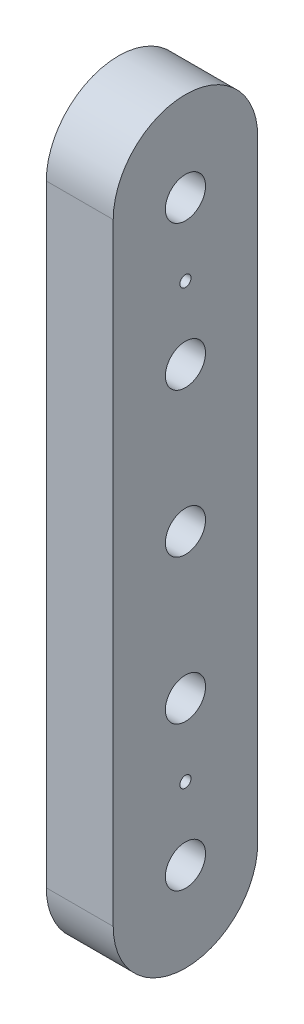
ISO-10303-21;
HEADER;
FILE_DESCRIPTION(('STEP AP214'),'2;1');
FILE_NAME('part.step','',(''),(''),'','','');
FILE_SCHEMA(('AUTOMOTIVE_DESIGN { 1 0 10303 214 1 1 1 1 }'));
ENDSEC;
DATA;
#1=APPLICATION_CONTEXT('core data for automotive mechanical design processes');
#2=APPLICATION_PROTOCOL_DEFINITION('international standard','automotive_design',2000,#1);
#3=PRODUCT_CONTEXT('',#1,'mechanical');
#4=PRODUCT('Part','Part','',(#3));
#5=PRODUCT_RELATED_PRODUCT_CATEGORY('part','',(#4));
#6=PRODUCT_DEFINITION_FORMATION('','',#4);
#7=PRODUCT_DEFINITION_CONTEXT('part definition',#1,'design');
#8=PRODUCT_DEFINITION('design','',#6,#7);
#9=PRODUCT_DEFINITION_SHAPE('','',#8);
#10=(LENGTH_UNIT() NAMED_UNIT(*) SI_UNIT(.MILLI.,.METRE.));
#11=(NAMED_UNIT(*) PLANE_ANGLE_UNIT() SI_UNIT($,.RADIAN.));
#12=(NAMED_UNIT(*) SI_UNIT($,.STERADIAN.) SOLID_ANGLE_UNIT());
#13=UNCERTAINTY_MEASURE_WITH_UNIT(LENGTH_MEASURE(1.E-05),#10,'distance_accuracy_value','');
#14=(GEOMETRIC_REPRESENTATION_CONTEXT(3) GLOBAL_UNCERTAINTY_ASSIGNED_CONTEXT((#13)) GLOBAL_UNIT_ASSIGNED_CONTEXT((#10,
#11,#12)) REPRESENTATION_CONTEXT('',''));
#15=CARTESIAN_POINT('',(0.,0.,0.));
#16=DIRECTION('',(0.,0.,1.));
#17=DIRECTION('',(1.,0.,0.));
#18=AXIS2_PLACEMENT_3D('',#15,#16,#17);
#19=CARTESIAN_POINT('',(990.146797213117,2028.05100619535,-164.79980395356));
#20=DIRECTION('',(1.,0.,0.));
#21=DIRECTION('',(0.,0.,-1.));
#22=AXIS2_PLACEMENT_3D('',#19,#20,#21);
#23=CYLINDRICAL_SURFACE('',#22,82.24980395356);
#24=CARTESIAN_POINT('',(1066.34679721312,2028.05100619535,-164.79980395356));
#25=DIRECTION('',(-1.,0.,0.));
#26=DIRECTION('',(0.,0.,1.));
#27=AXIS2_PLACEMENT_3D('',#24,#25,#26);
#28=CIRCLE('',#27,82.24980395356);
#29=CARTESIAN_POINT('',(1066.34679721312,2028.05100619535,-82.5500000000004));
#30=VERTEX_POINT('',#29);
#31=CARTESIAN_POINT('',(1066.34679721312,2028.05100619535,-247.04960790712));
#32=VERTEX_POINT('',#31);
#33=EDGE_CURVE('E111',#30,#32,#28,.T.);
#34=ORIENTED_EDGE('',*,*,#33,.T.);
#35=DIRECTION('',(1.,0.,0.));
#36=VECTOR('',#35,1.);
#37=CARTESIAN_POINT('',(990.146797213117,2028.05100619535,-247.04960790712));
#38=LINE('',#37,#36);
#39=CARTESIAN_POINT('',(990.146797213117,2028.05100619535,-247.04960790712));
#40=VERTEX_POINT('',#39);
#41=EDGE_CURVE('E13',#40,#32,#38,.T.);
#42=ORIENTED_EDGE('',*,*,#41,.F.);
#43=CARTESIAN_POINT('',(990.146797213117,2028.05100619535,-164.79980395356));
#44=DIRECTION('',(-1.,0.,0.));
#45=DIRECTION('',(0.,0.,1.));
#46=AXIS2_PLACEMENT_3D('',#43,#44,#45);
#47=CIRCLE('',#46,82.24980395356);
#48=CARTESIAN_POINT('',(990.146797213117,2028.05100619535,-82.5500000000004));
#49=VERTEX_POINT('',#48);
#50=EDGE_CURVE('E99',#49,#40,#47,.T.);
#51=ORIENTED_EDGE('',*,*,#50,.F.);
#52=DIRECTION('',(1.,0.,0.));
#53=VECTOR('',#52,1.);
#54=CARTESIAN_POINT('',(990.146797213117,2028.05100619535,-82.5500000000004));
#55=LINE('',#54,#53);
#56=EDGE_CURVE('E107',#49,#30,#55,.T.);
#57=ORIENTED_EDGE('',*,*,#56,.T.);
#58=EDGE_LOOP('',(#34,#42,#51,#57));
#59=FACE_BOUND('',#58,.T.);
#60=ADVANCED_FACE('F48',(#59),#23,.T.);
#61=CARTESIAN_POINT('',(990.146797213117,2028.05100619535,-247.04960790712));
#62=DIRECTION('',(0.,0.,1.));
#63=DIRECTION('',(0.,-1.,0.));
#64=AXIS2_PLACEMENT_3D('',#61,#62,#63);
#65=PLANE('',#64);
#66=DIRECTION('',(0.,-1.,0.));
#67=VECTOR('',#66,1.);
#68=CARTESIAN_POINT('',(1066.34679721312,2028.05100619535,-247.04960790712));
#69=LINE('',#68,#67);
#70=CARTESIAN_POINT('',(1066.34679721312,1331.16375694592,-247.049607907121));
#71=VERTEX_POINT('',#70);
#72=EDGE_CURVE('E103',#32,#71,#69,.T.);
#73=ORIENTED_EDGE('',*,*,#72,.T.);
#74=DIRECTION('',(1.,0.,0.));
#75=VECTOR('',#74,1.);
#76=CARTESIAN_POINT('',(990.146797213117,1331.16375694592,-247.049607907121));
#77=LINE('',#76,#75);
#78=CARTESIAN_POINT('',(990.146797213117,1331.16375694592,-247.049607907121));
#79=VERTEX_POINT('',#78);
#80=EDGE_CURVE('E56',#79,#71,#77,.T.);
#81=ORIENTED_EDGE('',*,*,#80,.F.);
#82=DIRECTION('',(0.,-1.,0.));
#83=VECTOR('',#82,1.);
#84=CARTESIAN_POINT('',(990.146797213117,2028.05100619535,-247.04960790712));
#85=LINE('',#84,#83);
#86=EDGE_CURVE('E94',#40,#79,#85,.T.);
#87=ORIENTED_EDGE('',*,*,#86,.F.);
#88=ORIENTED_EDGE('',*,*,#41,.T.);
#89=EDGE_LOOP('',(#73,#81,#87,#88));
#90=FACE_BOUND('',#89,.T.);
#91=ADVANCED_FACE('F102',(#90),#65,.F.);
#92=CARTESIAN_POINT('',(990.146797213117,1331.16375694592,-164.79980395356));
#93=DIRECTION('',(1.,0.,0.));
#94=DIRECTION('',(0.,0.,-1.));
#95=AXIS2_PLACEMENT_3D('',#92,#93,#94);
#96=CYLINDRICAL_SURFACE('',#95,82.2498039535603);
#97=CARTESIAN_POINT('',(1066.34679721312,1331.16375694592,-164.79980395356));
#98=DIRECTION('',(-1.,0.,0.));
#99=DIRECTION('',(0.,0.,1.));
#100=AXIS2_PLACEMENT_3D('',#97,#98,#99);
#101=CIRCLE('',#100,82.2498039535603);
#102=CARTESIAN_POINT('',(1066.34679721312,1331.16375694592,-82.5499999999999));
#103=VERTEX_POINT('',#102);
#104=EDGE_CURVE('E81',#71,#103,#101,.T.);
#105=ORIENTED_EDGE('',*,*,#104,.T.);
#106=DIRECTION('',(1.,0.,0.));
#107=VECTOR('',#106,1.);
#108=CARTESIAN_POINT('',(990.146797213117,1331.16375694592,-82.5499999999999));
#109=LINE('',#108,#107);
#110=CARTESIAN_POINT('',(990.146797213117,1331.16375694592,-82.5499999999999));
#111=VERTEX_POINT('',#110);
#112=EDGE_CURVE('E104',#111,#103,#109,.T.);
#113=ORIENTED_EDGE('',*,*,#112,.F.);
#114=CARTESIAN_POINT('',(990.146797213117,1331.16375694592,-164.79980395356));
#115=DIRECTION('',(-1.,0.,0.));
#116=DIRECTION('',(0.,0.,1.));
#117=AXIS2_PLACEMENT_3D('',#114,#115,#116);
#118=CIRCLE('',#117,82.2498039535603);
#119=EDGE_CURVE('E97',#79,#111,#118,.T.);
#120=ORIENTED_EDGE('',*,*,#119,.F.);
#121=ORIENTED_EDGE('',*,*,#80,.T.);
#122=EDGE_LOOP('',(#105,#113,#120,#121));
#123=FACE_BOUND('',#122,.T.);
#124=ADVANCED_FACE('F105',(#123),#96,.T.);
#125=CARTESIAN_POINT('',(990.146797213117,1331.16375694592,-82.5499999999999));
#126=DIRECTION('',(0.,0.,-1.));
#127=DIRECTION('',(0.,1.,0.));
#128=AXIS2_PLACEMENT_3D('',#125,#126,#127);
#129=PLANE('',#128);
#130=DIRECTION('',(0.,1.,0.));
#131=VECTOR('',#130,1.);
#132=CARTESIAN_POINT('',(1066.34679721312,1331.16375694592,-82.5499999999999));
#133=LINE('',#132,#131);
#134=EDGE_CURVE('E87',#103,#30,#133,.T.);
#135=ORIENTED_EDGE('',*,*,#134,.T.);
#136=ORIENTED_EDGE('',*,*,#56,.F.);
#137=DIRECTION('',(0.,1.,0.));
#138=VECTOR('',#137,1.);
#139=CARTESIAN_POINT('',(990.146797213117,1331.16375694592,-82.5499999999999));
#140=LINE('',#139,#138);
#141=EDGE_CURVE('E64',#111,#49,#140,.T.);
#142=ORIENTED_EDGE('',*,*,#141,.F.);
#143=ORIENTED_EDGE('',*,*,#112,.T.);
#144=EDGE_LOOP('',(#135,#136,#142,#143));
#145=FACE_BOUND('',#144,.T.);
#146=ADVANCED_FACE('F119',(#145),#129,.F.);
#147=CARTESIAN_POINT('',(990.146797213117,2028.05100619535,-164.79980395356));
#148=DIRECTION('',(-1.,0.,0.));
#149=DIRECTION('',(0.,0.,1.));
#150=AXIS2_PLACEMENT_3D('',#147,#148,#149);
#151=PLANE('',#150);
#152=CARTESIAN_POINT('',(990.146797213117,1432.78731013693,-164.79980395356));
#153=DIRECTION('',(-1.,0.,0.));
#154=DIRECTION('',(0.,0.,1.));
#155=AXIS2_PLACEMENT_3D('',#152,#153,#154);
#156=CIRCLE('',#155,6.35000000000002);
#157=CARTESIAN_POINT('',(990.146797213117,1432.78731013693,-158.44980395356));
#158=VERTEX_POINT('',#157);
#159=EDGE_CURVE('E161',#158,#158,#156,.F.);
#160=ORIENTED_EDGE('',*,*,#159,.T.);
#161=EDGE_LOOP('',(#160));
#162=FACE_BOUND('',#161,.T.);
#163=CARTESIAN_POINT('',(990.146797213117,1926.42745300434,-164.79980395356));
#164=DIRECTION('',(-1.,0.,0.));
#165=DIRECTION('',(0.,0.,1.));
#166=AXIS2_PLACEMENT_3D('',#163,#164,#165);
#167=CIRCLE('',#166,6.35000000000002);
#168=CARTESIAN_POINT('',(990.146797213117,1926.42745300434,-158.44980395356));
#169=VERTEX_POINT('',#168);
#170=EDGE_CURVE('E155',#169,#169,#167,.F.);
#171=ORIENTED_EDGE('',*,*,#170,.T.);
#172=EDGE_LOOP('',(#171));
#173=FACE_BOUND('',#172,.T.);
#174=CARTESIAN_POINT('',(990.146797213117,1350.51395299236,-164.79980395356));
#175=DIRECTION('',(-1.,0.,0.));
#176=DIRECTION('',(0.,0.,1.));
#177=AXIS2_PLACEMENT_3D('',#174,#175,#176);
#178=CIRCLE('',#177,22.86);
#179=CARTESIAN_POINT('',(990.146797213117,1350.51395299236,-141.93980395356));
#180=VERTEX_POINT('',#179);
#181=EDGE_CURVE('E149',#180,#180,#178,.F.);
#182=ORIENTED_EDGE('',*,*,#181,.T.);
#183=EDGE_LOOP('',(#182));
#184=FACE_BOUND('',#183,.T.);
#185=CARTESIAN_POINT('',(990.146797213117,1515.0606672815,-164.79980395356));
#186=DIRECTION('',(-1.,0.,0.));
#187=DIRECTION('',(0.,0.,1.));
#188=AXIS2_PLACEMENT_3D('',#185,#186,#187);
#189=CIRCLE('',#188,22.86);
#190=CARTESIAN_POINT('',(990.146797213117,1515.0606672815,-141.93980395356));
#191=VERTEX_POINT('',#190);
#192=EDGE_CURVE('E143',#191,#191,#189,.F.);
#193=ORIENTED_EDGE('',*,*,#192,.T.);
#194=EDGE_LOOP('',(#193));
#195=FACE_BOUND('',#194,.T.);
#196=CARTESIAN_POINT('',(990.146797213117,2008.70081014891,-164.79980395356));
#197=DIRECTION('',(-1.,0.,0.));
#198=DIRECTION('',(0.,0.,1.));
#199=AXIS2_PLACEMENT_3D('',#196,#197,#198);
#200=CIRCLE('',#199,22.86);
#201=CARTESIAN_POINT('',(990.146797213117,2008.70081014891,-141.93980395356));
#202=VERTEX_POINT('',#201);
#203=EDGE_CURVE('E137',#202,#202,#200,.F.);
#204=ORIENTED_EDGE('',*,*,#203,.T.);
#205=EDGE_LOOP('',(#204));
#206=FACE_BOUND('',#205,.T.);
#207=CARTESIAN_POINT('',(990.146797213117,1679.60738157062,-164.79980395356));
#208=DIRECTION('',(-1.,0.,0.));
#209=DIRECTION('',(0.,0.,1.));
#210=AXIS2_PLACEMENT_3D('',#207,#208,#209);
#211=CIRCLE('',#210,22.860000000004);
#212=CARTESIAN_POINT('',(990.146797213117,1679.60738157062,-141.939803953556));
#213=VERTEX_POINT('',#212);
#214=EDGE_CURVE('E131',#213,#213,#211,.F.);
#215=ORIENTED_EDGE('',*,*,#214,.T.);
#216=EDGE_LOOP('',(#215));
#217=FACE_BOUND('',#216,.T.);
#218=CARTESIAN_POINT('',(990.146797213117,1844.15409585977,-164.79980395356));
#219=DIRECTION('',(-1.,0.,0.));
#220=DIRECTION('',(0.,0.,1.));
#221=AXIS2_PLACEMENT_3D('',#218,#219,#220);
#222=CIRCLE('',#221,22.86);
#223=CARTESIAN_POINT('',(990.146797213117,1844.15409585977,-141.93980395356));
#224=VERTEX_POINT('',#223);
#225=EDGE_CURVE('E125',#224,#224,#222,.F.);
#226=ORIENTED_EDGE('',*,*,#225,.T.);
#227=EDGE_LOOP('',(#226));
#228=FACE_BOUND('',#227,.T.);
#229=ORIENTED_EDGE('',*,*,#50,.T.);
#230=ORIENTED_EDGE('',*,*,#86,.T.);
#231=ORIENTED_EDGE('',*,*,#119,.T.);
#232=ORIENTED_EDGE('',*,*,#141,.T.);
#233=EDGE_LOOP('',(#229,#230,#231,#232));
#234=FACE_BOUND('',#233,.T.);
#235=ADVANCED_FACE('F95',(#162,#173,#184,#195,#206,#217,#228,#234),#151,.T.);
#236=CARTESIAN_POINT('',(1066.34679721312,2028.05100619535,-164.79980395356));
#237=DIRECTION('',(-1.,0.,0.));
#238=DIRECTION('',(0.,0.,1.));
#239=AXIS2_PLACEMENT_3D('',#236,#237,#238);
#240=PLANE('',#239);
#241=CARTESIAN_POINT('',(1066.34679721312,1432.78731013693,-164.79980395356));
#242=DIRECTION('',(1.,0.,0.));
#243=DIRECTION('',(0.,0.,-1.));
#244=AXIS2_PLACEMENT_3D('',#241,#242,#243);
#245=CIRCLE('',#244,6.35000000000002);
#246=CARTESIAN_POINT('',(1066.34679721312,1432.78731013693,-171.14980395356));
#247=VERTEX_POINT('',#246);
#248=EDGE_CURVE('E158',#247,#247,#245,.T.);
#249=ORIENTED_EDGE('',*,*,#248,.F.);
#250=EDGE_LOOP('',(#249));
#251=FACE_BOUND('',#250,.T.);
#252=CARTESIAN_POINT('',(1066.34679721312,1926.42745300434,-164.79980395356));
#253=DIRECTION('',(1.,0.,0.));
#254=DIRECTION('',(0.,0.,-1.));
#255=AXIS2_PLACEMENT_3D('',#252,#253,#254);
#256=CIRCLE('',#255,6.35000000000002);
#257=CARTESIAN_POINT('',(1066.34679721312,1926.42745300434,-171.14980395356));
#258=VERTEX_POINT('',#257);
#259=EDGE_CURVE('E152',#258,#258,#256,.T.);
#260=ORIENTED_EDGE('',*,*,#259,.F.);
#261=EDGE_LOOP('',(#260));
#262=FACE_BOUND('',#261,.T.);
#263=CARTESIAN_POINT('',(1066.34679721312,1350.51395299236,-164.79980395356));
#264=DIRECTION('',(1.,0.,0.));
#265=DIRECTION('',(0.,0.,-1.));
#266=AXIS2_PLACEMENT_3D('',#263,#264,#265);
#267=CIRCLE('',#266,22.86);
#268=CARTESIAN_POINT('',(1066.34679721312,1350.51395299236,-187.65980395356));
#269=VERTEX_POINT('',#268);
#270=EDGE_CURVE('E146',#269,#269,#267,.T.);
#271=ORIENTED_EDGE('',*,*,#270,.F.);
#272=EDGE_LOOP('',(#271));
#273=FACE_BOUND('',#272,.T.);
#274=CARTESIAN_POINT('',(1066.34679721312,1515.0606672815,-164.79980395356));
#275=DIRECTION('',(1.,0.,0.));
#276=DIRECTION('',(0.,0.,-1.));
#277=AXIS2_PLACEMENT_3D('',#274,#275,#276);
#278=CIRCLE('',#277,22.86);
#279=CARTESIAN_POINT('',(1066.34679721312,1515.0606672815,-187.65980395356));
#280=VERTEX_POINT('',#279);
#281=EDGE_CURVE('E140',#280,#280,#278,.T.);
#282=ORIENTED_EDGE('',*,*,#281,.F.);
#283=EDGE_LOOP('',(#282));
#284=FACE_BOUND('',#283,.T.);
#285=CARTESIAN_POINT('',(1066.34679721312,2008.70081014891,-164.79980395356));
#286=DIRECTION('',(1.,0.,0.));
#287=DIRECTION('',(0.,0.,-1.));
#288=AXIS2_PLACEMENT_3D('',#285,#286,#287);
#289=CIRCLE('',#288,22.86);
#290=CARTESIAN_POINT('',(1066.34679721312,2008.70081014891,-187.65980395356));
#291=VERTEX_POINT('',#290);
#292=EDGE_CURVE('E134',#291,#291,#289,.T.);
#293=ORIENTED_EDGE('',*,*,#292,.F.);
#294=EDGE_LOOP('',(#293));
#295=FACE_BOUND('',#294,.T.);
#296=CARTESIAN_POINT('',(1066.34679721312,1679.60738157062,-164.79980395356));
#297=DIRECTION('',(1.,0.,0.));
#298=DIRECTION('',(0.,0.,-1.));
#299=AXIS2_PLACEMENT_3D('',#296,#297,#298);
#300=CIRCLE('',#299,22.860000000004);
#301=CARTESIAN_POINT('',(1066.34679721312,1679.60738157062,-187.659803953564));
#302=VERTEX_POINT('',#301);
#303=EDGE_CURVE('E128',#302,#302,#300,.T.);
#304=ORIENTED_EDGE('',*,*,#303,.F.);
#305=EDGE_LOOP('',(#304));
#306=FACE_BOUND('',#305,.T.);
#307=CARTESIAN_POINT('',(1066.34679721312,1844.15409585977,-164.79980395356));
#308=DIRECTION('',(1.,0.,0.));
#309=DIRECTION('',(0.,0.,-1.));
#310=AXIS2_PLACEMENT_3D('',#307,#308,#309);
#311=CIRCLE('',#310,22.86);
#312=CARTESIAN_POINT('',(1066.34679721312,1844.15409585977,-187.65980395356));
#313=VERTEX_POINT('',#312);
#314=EDGE_CURVE('E114',#313,#313,#311,.T.);
#315=ORIENTED_EDGE('',*,*,#314,.F.);
#316=EDGE_LOOP('',(#315));
#317=FACE_BOUND('',#316,.T.);
#318=ORIENTED_EDGE('',*,*,#33,.F.);
#319=ORIENTED_EDGE('',*,*,#134,.F.);
#320=ORIENTED_EDGE('',*,*,#104,.F.);
#321=ORIENTED_EDGE('',*,*,#72,.F.);
#322=EDGE_LOOP('',(#318,#319,#320,#321));
#323=FACE_BOUND('',#322,.T.);
#324=ADVANCED_FACE('F122',(#251,#262,#273,#284,#295,#306,#317,#323),#240,.F.);
#325=CARTESIAN_POINT('',(990.145797213117,1844.15409585977,-164.79980395356));
#326=DIRECTION('',(1.,0.,0.));
#327=DIRECTION('',(0.,0.,-1.));
#328=AXIS2_PLACEMENT_3D('',#325,#326,#327);
#329=CYLINDRICAL_SURFACE('',#328,22.86);
#330=ORIENTED_EDGE('',*,*,#225,.F.);
#331=EDGE_LOOP('',(#330));
#332=FACE_BOUND('',#331,.T.);
#333=ORIENTED_EDGE('',*,*,#314,.T.);
#334=EDGE_LOOP('',(#333));
#335=FACE_BOUND('',#334,.T.);
#336=ADVANCED_FACE('F171',(#332,#335),#329,.F.);
#337=CARTESIAN_POINT('',(990.145797213117,1679.60738157062,-164.79980395356));
#338=DIRECTION('',(1.,0.,0.));
#339=DIRECTION('',(0.,0.,-1.));
#340=AXIS2_PLACEMENT_3D('',#337,#338,#339);
#341=CYLINDRICAL_SURFACE('',#340,22.860000000004);
#342=ORIENTED_EDGE('',*,*,#214,.F.);
#343=EDGE_LOOP('',(#342));
#344=FACE_BOUND('',#343,.T.);
#345=ORIENTED_EDGE('',*,*,#303,.T.);
#346=EDGE_LOOP('',(#345));
#347=FACE_BOUND('',#346,.T.);
#348=ADVANCED_FACE('F186',(#344,#347),#341,.F.);
#349=CARTESIAN_POINT('',(990.145797213117,2008.70081014891,-164.79980395356));
#350=DIRECTION('',(1.,0.,0.));
#351=DIRECTION('',(0.,0.,-1.));
#352=AXIS2_PLACEMENT_3D('',#349,#350,#351);
#353=CYLINDRICAL_SURFACE('',#352,22.86);
#354=ORIENTED_EDGE('',*,*,#203,.F.);
#355=EDGE_LOOP('',(#354));
#356=FACE_BOUND('',#355,.T.);
#357=ORIENTED_EDGE('',*,*,#292,.T.);
#358=EDGE_LOOP('',(#357));
#359=FACE_BOUND('',#358,.T.);
#360=ADVANCED_FACE('F192',(#356,#359),#353,.F.);
#361=CARTESIAN_POINT('',(990.145797213117,1515.0606672815,-164.79980395356));
#362=DIRECTION('',(1.,0.,0.));
#363=DIRECTION('',(0.,0.,-1.));
#364=AXIS2_PLACEMENT_3D('',#361,#362,#363);
#365=CYLINDRICAL_SURFACE('',#364,22.86);
#366=ORIENTED_EDGE('',*,*,#192,.F.);
#367=EDGE_LOOP('',(#366));
#368=FACE_BOUND('',#367,.T.);
#369=ORIENTED_EDGE('',*,*,#281,.T.);
#370=EDGE_LOOP('',(#369));
#371=FACE_BOUND('',#370,.T.);
#372=ADVANCED_FACE('F227',(#368,#371),#365,.F.);
#373=CARTESIAN_POINT('',(990.145797213117,1350.51395299236,-164.79980395356));
#374=DIRECTION('',(1.,0.,0.));
#375=DIRECTION('',(0.,0.,-1.));
#376=AXIS2_PLACEMENT_3D('',#373,#374,#375);
#377=CYLINDRICAL_SURFACE('',#376,22.86);
#378=ORIENTED_EDGE('',*,*,#181,.F.);
#379=EDGE_LOOP('',(#378));
#380=FACE_BOUND('',#379,.T.);
#381=ORIENTED_EDGE('',*,*,#270,.T.);
#382=EDGE_LOOP('',(#381));
#383=FACE_BOUND('',#382,.T.);
#384=ADVANCED_FACE('F232',(#380,#383),#377,.F.);
#385=CARTESIAN_POINT('',(990.145797213117,1926.42745300434,-164.79980395356));
#386=DIRECTION('',(1.,0.,0.));
#387=DIRECTION('',(0.,0.,-1.));
#388=AXIS2_PLACEMENT_3D('',#385,#386,#387);
#389=CYLINDRICAL_SURFACE('',#388,6.35000000000002);
#390=ORIENTED_EDGE('',*,*,#170,.F.);
#391=EDGE_LOOP('',(#390));
#392=FACE_BOUND('',#391,.T.);
#393=ORIENTED_EDGE('',*,*,#259,.T.);
#394=EDGE_LOOP('',(#393));
#395=FACE_BOUND('',#394,.T.);
#396=ADVANCED_FACE('F238',(#392,#395),#389,.F.);
#397=CARTESIAN_POINT('',(990.145797213117,1432.78731013693,-164.79980395356));
#398=DIRECTION('',(1.,0.,0.));
#399=DIRECTION('',(0.,0.,-1.));
#400=AXIS2_PLACEMENT_3D('',#397,#398,#399);
#401=CYLINDRICAL_SURFACE('',#400,6.35000000000002);
#402=ORIENTED_EDGE('',*,*,#159,.F.);
#403=EDGE_LOOP('',(#402));
#404=FACE_BOUND('',#403,.T.);
#405=ORIENTED_EDGE('',*,*,#248,.T.);
#406=EDGE_LOOP('',(#405));
#407=FACE_BOUND('',#406,.T.);
#408=ADVANCED_FACE('F167',(#404,#407),#401,.F.);
#409=CLOSED_SHELL('',(#60,#91,#124,#146,#235,#324,#336,#348,#360,#372,#384,#396,#408));
#410=MANIFOLD_SOLID_BREP('B2',#409);
#411=ADVANCED_BREP_SHAPE_REPRESENTATION('',(#18,#410),#14);
#412=SHAPE_DEFINITION_REPRESENTATION(#9,#411);
ENDSEC;
END-ISO-10303-21;
